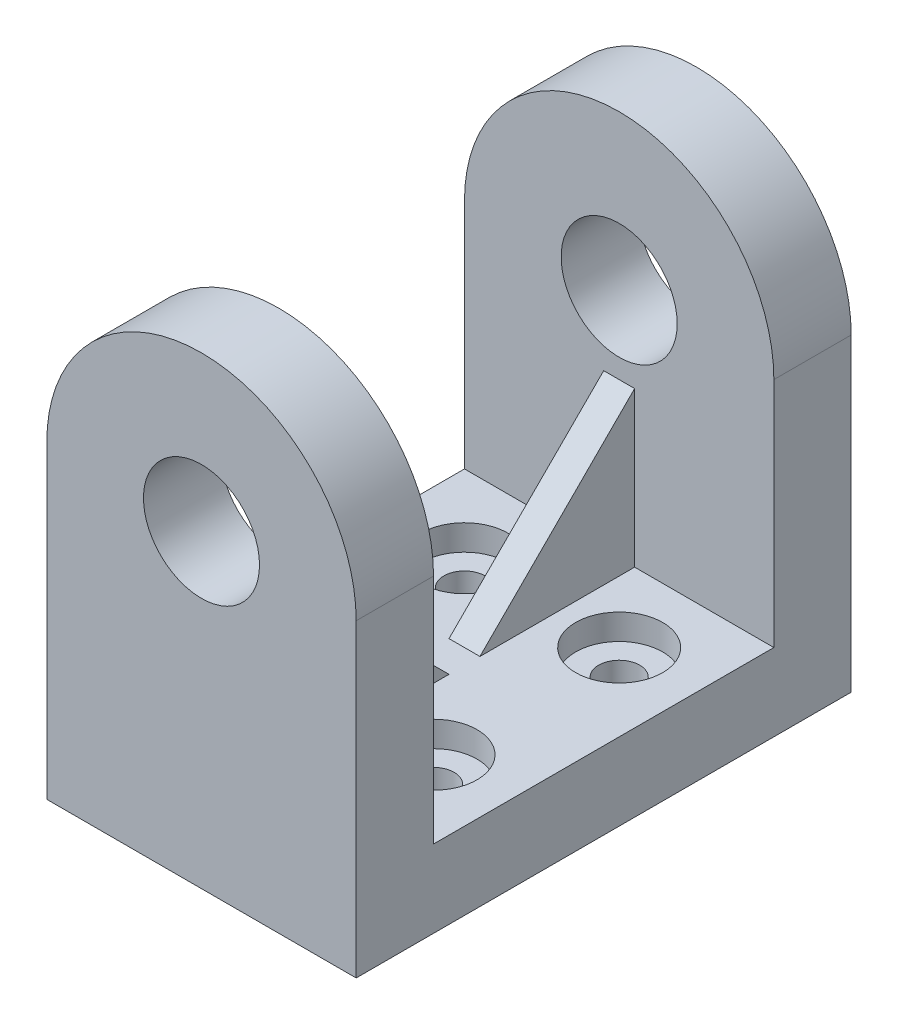
ISO-10303-21;
HEADER;
FILE_DESCRIPTION(('STEP AP214'),'2;1');
FILE_NAME('part.step','',(''),(''),'','','');
FILE_SCHEMA(('AUTOMOTIVE_DESIGN { 1 0 10303 214 1 1 1 1 }'));
ENDSEC;
DATA;
#1=APPLICATION_CONTEXT('core data for automotive mechanical design processes');
#2=APPLICATION_PROTOCOL_DEFINITION('international standard','automotive_design',2000,#1);
#3=PRODUCT_CONTEXT('',#1,'mechanical');
#4=PRODUCT('Part','Part','',(#3));
#5=PRODUCT_RELATED_PRODUCT_CATEGORY('part','',(#4));
#6=PRODUCT_DEFINITION_FORMATION('','',#4);
#7=PRODUCT_DEFINITION_CONTEXT('part definition',#1,'design');
#8=PRODUCT_DEFINITION('design','',#6,#7);
#9=PRODUCT_DEFINITION_SHAPE('','',#8);
#10=(LENGTH_UNIT() NAMED_UNIT(*) SI_UNIT(.MILLI.,.METRE.));
#11=(NAMED_UNIT(*) PLANE_ANGLE_UNIT() SI_UNIT($,.RADIAN.));
#12=(NAMED_UNIT(*) SI_UNIT($,.STERADIAN.) SOLID_ANGLE_UNIT());
#13=UNCERTAINTY_MEASURE_WITH_UNIT(LENGTH_MEASURE(1.E-05),#10,'distance_accuracy_value','');
#14=(GEOMETRIC_REPRESENTATION_CONTEXT(3) GLOBAL_UNCERTAINTY_ASSIGNED_CONTEXT((#13)) GLOBAL_UNIT_ASSIGNED_CONTEXT((#10,
#11,#12)) REPRESENTATION_CONTEXT('',''));
#15=CARTESIAN_POINT('',(0.,0.,0.));
#16=DIRECTION('',(0.,0.,1.));
#17=DIRECTION('',(1.,0.,0.));
#18=AXIS2_PLACEMENT_3D('',#15,#16,#17);
#19=CARTESIAN_POINT('',(0.,12.7,27.94));
#20=DIRECTION('',(0.,1.,0.));
#21=DIRECTION('',(-1.,0.,0.));
#22=AXIS2_PLACEMENT_3D('',#19,#20,#21);
#23=PLANE('',#22);
#24=CARTESIAN_POINT('',(-12.7,12.7,-15.24));
#25=DIRECTION('',(0.,1.,0.));
#26=DIRECTION('',(0.,0.,1.));
#27=AXIS2_PLACEMENT_3D('',#24,#25,#26);
#28=CIRCLE('',#27,7.14375);
#29=CARTESIAN_POINT('',(-12.7,12.7,-8.09625));
#30=VERTEX_POINT('',#29);
#31=EDGE_CURVE('E398',#30,#30,#28,.T.);
#32=ORIENTED_EDGE('',*,*,#31,.F.);
#33=EDGE_LOOP('',(#32));
#34=FACE_BOUND('',#33,.T.);
#35=CARTESIAN_POINT('',(-12.7,12.7,15.24));
#36=DIRECTION('',(0.,1.,0.));
#37=DIRECTION('',(0.,0.,1.));
#38=AXIS2_PLACEMENT_3D('',#35,#36,#37);
#39=CIRCLE('',#38,7.14375);
#40=CARTESIAN_POINT('',(-12.7,12.7,22.38375));
#41=VERTEX_POINT('',#40);
#42=EDGE_CURVE('E402',#41,#41,#39,.T.);
#43=ORIENTED_EDGE('',*,*,#42,.F.);
#44=EDGE_LOOP('',(#43));
#45=FACE_BOUND('',#44,.T.);
#46=CARTESIAN_POINT('',(12.7,12.7,-15.24));
#47=DIRECTION('',(0.,1.,0.));
#48=DIRECTION('',(0.,0.,1.));
#49=AXIS2_PLACEMENT_3D('',#46,#47,#48);
#50=CIRCLE('',#49,7.14375);
#51=CARTESIAN_POINT('',(12.7,12.7,-8.09625));
#52=VERTEX_POINT('',#51);
#53=EDGE_CURVE('E406',#52,#52,#50,.T.);
#54=ORIENTED_EDGE('',*,*,#53,.F.);
#55=EDGE_LOOP('',(#54));
#56=FACE_BOUND('',#55,.T.);
#57=CARTESIAN_POINT('',(12.7,12.7,15.24));
#58=DIRECTION('',(0.,1.,0.));
#59=DIRECTION('',(0.,0.,1.));
#60=AXIS2_PLACEMENT_3D('',#57,#58,#59);
#61=CIRCLE('',#60,7.14375);
#62=CARTESIAN_POINT('',(12.7,12.7,22.38375));
#63=VERTEX_POINT('',#62);
#64=EDGE_CURVE('E409',#63,#63,#61,.T.);
#65=ORIENTED_EDGE('',*,*,#64,.F.);
#66=EDGE_LOOP('',(#65));
#67=FACE_BOUND('',#66,.T.);
#68=DIRECTION('',(0.,0.,-1.));
#69=VECTOR('',#68,1.);
#70=CARTESIAN_POINT('',(2.54,12.7,27.94));
#71=LINE('',#70,#69);
#72=CARTESIAN_POINT('',(2.54,12.7,-2.54000000000009));
#73=VERTEX_POINT('',#72);
#74=CARTESIAN_POINT('',(2.54,12.7,-27.94));
#75=VERTEX_POINT('',#74);
#76=EDGE_CURVE('E167',#73,#75,#71,.T.);
#77=ORIENTED_EDGE('',*,*,#76,.F.);
#78=DIRECTION('',(1.,0.,0.));
#79=VECTOR('',#78,1.);
#80=CARTESIAN_POINT('',(0.,12.7,-2.5400000000001));
#81=LINE('',#80,#79);
#82=CARTESIAN_POINT('',(-2.54,12.7,-2.54000000000009));
#83=VERTEX_POINT('',#82);
#84=EDGE_CURVE('E157',#83,#73,#81,.T.);
#85=ORIENTED_EDGE('',*,*,#84,.F.);
#86=DIRECTION('',(0.,0.,-1.));
#87=VECTOR('',#86,1.);
#88=CARTESIAN_POINT('',(-2.54,12.7,27.94));
#89=LINE('',#88,#87);
#90=CARTESIAN_POINT('',(-2.54,12.7,-27.94));
#91=VERTEX_POINT('',#90);
#92=EDGE_CURVE('E144',#83,#91,#89,.T.);
#93=ORIENTED_EDGE('',*,*,#92,.T.);
#94=DIRECTION('',(1.,0.,0.));
#95=VECTOR('',#94,1.);
#96=CARTESIAN_POINT('',(0.,12.7,-27.94));
#97=LINE('',#96,#95);
#98=CARTESIAN_POINT('',(-25.4,12.7,-27.94));
#99=VERTEX_POINT('',#98);
#100=EDGE_CURVE('E285',#99,#91,#97,.T.);
#101=ORIENTED_EDGE('',*,*,#100,.F.);
#102=DIRECTION('',(0.,0.,-1.));
#103=VECTOR('',#102,1.);
#104=CARTESIAN_POINT('',(-25.4,12.7,27.94));
#105=LINE('',#104,#103);
#106=CARTESIAN_POINT('',(-25.4,12.7,27.94));
#107=VERTEX_POINT('',#106);
#108=EDGE_CURVE('E11',#107,#99,#105,.T.);
#109=ORIENTED_EDGE('',*,*,#108,.F.);
#110=DIRECTION('',(1.,0.,0.));
#111=VECTOR('',#110,1.);
#112=CARTESIAN_POINT('',(0.,12.7,27.94));
#113=LINE('',#112,#111);
#114=CARTESIAN_POINT('',(-2.54,12.7,27.94));
#115=VERTEX_POINT('',#114);
#116=EDGE_CURVE('E279',#107,#115,#113,.T.);
#117=ORIENTED_EDGE('',*,*,#116,.T.);
#118=DIRECTION('',(0.,0.,-1.));
#119=VECTOR('',#118,1.);
#120=CARTESIAN_POINT('',(-2.54,12.7,27.94));
#121=LINE('',#120,#119);
#122=CARTESIAN_POINT('',(-2.54,12.7,2.54000000000009));
#123=VERTEX_POINT('',#122);
#124=EDGE_CURVE('E187',#115,#123,#121,.T.);
#125=ORIENTED_EDGE('',*,*,#124,.T.);
#126=DIRECTION('',(1.,0.,0.));
#127=VECTOR('',#126,1.);
#128=CARTESIAN_POINT('',(0.,12.7,2.5400000000001));
#129=LINE('',#128,#127);
#130=CARTESIAN_POINT('',(2.54,12.7,2.5400000000001));
#131=VERTEX_POINT('',#130);
#132=EDGE_CURVE('E69',#131,#123,#129,.F.);
#133=ORIENTED_EDGE('',*,*,#132,.F.);
#134=DIRECTION('',(0.,0.,-1.));
#135=VECTOR('',#134,1.);
#136=CARTESIAN_POINT('',(2.54,12.7,27.94));
#137=LINE('',#136,#135);
#138=CARTESIAN_POINT('',(2.54,12.7,27.94));
#139=VERTEX_POINT('',#138);
#140=EDGE_CURVE('E193',#139,#131,#137,.T.);
#141=ORIENTED_EDGE('',*,*,#140,.F.);
#142=CARTESIAN_POINT('',(25.4,12.7,27.94));
#143=VERTEX_POINT('',#142);
#144=EDGE_CURVE('E284',#139,#143,#113,.T.);
#145=ORIENTED_EDGE('',*,*,#144,.T.);
#146=DIRECTION('',(0.,0.,-1.));
#147=VECTOR('',#146,1.);
#148=CARTESIAN_POINT('',(25.4,12.7,27.94));
#149=LINE('',#148,#147);
#150=CARTESIAN_POINT('',(25.4,12.7,-27.94));
#151=VERTEX_POINT('',#150);
#152=EDGE_CURVE('E283',#143,#151,#149,.T.);
#153=ORIENTED_EDGE('',*,*,#152,.T.);
#154=EDGE_CURVE('E275',#75,#151,#97,.T.);
#155=ORIENTED_EDGE('',*,*,#154,.F.);
#156=EDGE_LOOP('',(#77,#85,#93,#101,#109,#117,#125,#133,#141,#145,#153,#155));
#157=FACE_BOUND('',#156,.T.);
#158=ADVANCED_FACE('F45',(#34,#45,#56,#67,#157),#23,.T.);
#159=CARTESIAN_POINT('',(-25.4,0.,27.94));
#160=DIRECTION('',(1.,0.,0.));
#161=DIRECTION('',(0.,1.,0.));
#162=AXIS2_PLACEMENT_3D('',#159,#160,#161);
#163=PLANE('',#162);
#164=ORIENTED_EDGE('',*,*,#108,.T.);
#165=DIRECTION('',(0.,-1.,0.));
#166=VECTOR('',#165,1.);
#167=CARTESIAN_POINT('',(-25.4,0.,-27.94));
#168=LINE('',#167,#166);
#169=CARTESIAN_POINT('',(-25.4,50.8,-27.94));
#170=VERTEX_POINT('',#169);
#171=EDGE_CURVE('E234',#170,#99,#168,.T.);
#172=ORIENTED_EDGE('',*,*,#171,.F.);
#173=DIRECTION('',(0.,0.,1.));
#174=VECTOR('',#173,1.);
#175=CARTESIAN_POINT('',(-25.4,50.8,-40.64));
#176=LINE('',#175,#174);
#177=CARTESIAN_POINT('',(-25.4,50.8,-40.64));
#178=VERTEX_POINT('',#177);
#179=EDGE_CURVE('E230',#178,#170,#176,.T.);
#180=ORIENTED_EDGE('',*,*,#179,.F.);
#181=DIRECTION('',(0.,-1.,0.));
#182=VECTOR('',#181,1.);
#183=CARTESIAN_POINT('',(-25.4,0.,-40.64));
#184=LINE('',#183,#182);
#185=CARTESIAN_POINT('',(-25.4,0.,-40.64));
#186=VERTEX_POINT('',#185);
#187=EDGE_CURVE('E218',#178,#186,#184,.T.);
#188=ORIENTED_EDGE('',*,*,#187,.T.);
#189=DIRECTION('',(0.,0.,-1.));
#190=VECTOR('',#189,1.);
#191=CARTESIAN_POINT('',(-25.4,0.,27.94));
#192=LINE('',#191,#190);
#193=CARTESIAN_POINT('',(-25.4,0.,40.64));
#194=VERTEX_POINT('',#193);
#195=EDGE_CURVE('E54',#194,#186,#192,.T.);
#196=ORIENTED_EDGE('',*,*,#195,.F.);
#197=DIRECTION('',(0.,1.,0.));
#198=VECTOR('',#197,1.);
#199=CARTESIAN_POINT('',(-25.4,0.,40.64));
#200=LINE('',#199,#198);
#201=CARTESIAN_POINT('',(-25.4,50.8,40.64));
#202=VERTEX_POINT('',#201);
#203=EDGE_CURVE('E255',#194,#202,#200,.T.);
#204=ORIENTED_EDGE('',*,*,#203,.T.);
#205=DIRECTION('',(0.,0.,-1.));
#206=VECTOR('',#205,1.);
#207=CARTESIAN_POINT('',(-25.4,50.8,40.64));
#208=LINE('',#207,#206);
#209=CARTESIAN_POINT('',(-25.4,50.8,27.94));
#210=VERTEX_POINT('',#209);
#211=EDGE_CURVE('E262',#202,#210,#208,.T.);
#212=ORIENTED_EDGE('',*,*,#211,.T.);
#213=DIRECTION('',(0.,1.,0.));
#214=VECTOR('',#213,1.);
#215=CARTESIAN_POINT('',(-25.4,0.,27.94));
#216=LINE('',#215,#214);
#217=EDGE_CURVE('E266',#107,#210,#216,.T.);
#218=ORIENTED_EDGE('',*,*,#217,.F.);
#219=EDGE_LOOP('',(#164,#172,#180,#188,#196,#204,#212,#218));
#220=FACE_BOUND('',#219,.T.);
#221=ADVANCED_FACE('F309',(#220),#163,.F.);
#222=CARTESIAN_POINT('',(0.,0.,27.94));
#223=DIRECTION('',(0.,1.,0.));
#224=DIRECTION('',(-1.,0.,0.));
#225=AXIS2_PLACEMENT_3D('',#222,#223,#224);
#226=PLANE('',#225);
#227=CARTESIAN_POINT('',(-12.7,0.,-15.24));
#228=DIRECTION('',(0.,1.,0.));
#229=DIRECTION('',(0.,0.,1.));
#230=AXIS2_PLACEMENT_3D('',#227,#228,#229);
#231=CIRCLE('',#230,3.3782);
#232=CARTESIAN_POINT('',(-12.7,0.,-11.8618));
#233=VERTEX_POINT('',#232);
#234=EDGE_CURVE('E529',#233,#233,#231,.T.);
#235=ORIENTED_EDGE('',*,*,#234,.T.);
#236=EDGE_LOOP('',(#235));
#237=FACE_BOUND('',#236,.T.);
#238=CARTESIAN_POINT('',(-12.7,0.,15.24));
#239=DIRECTION('',(0.,1.,0.));
#240=DIRECTION('',(0.,0.,1.));
#241=AXIS2_PLACEMENT_3D('',#238,#239,#240);
#242=CIRCLE('',#241,3.3782);
#243=CARTESIAN_POINT('',(-12.7,0.,18.6182));
#244=VERTEX_POINT('',#243);
#245=EDGE_CURVE('E543',#244,#244,#242,.T.);
#246=ORIENTED_EDGE('',*,*,#245,.T.);
#247=EDGE_LOOP('',(#246));
#248=FACE_BOUND('',#247,.T.);
#249=CARTESIAN_POINT('',(12.7,0.,-15.24));
#250=DIRECTION('',(0.,1.,0.));
#251=DIRECTION('',(0.,0.,1.));
#252=AXIS2_PLACEMENT_3D('',#249,#250,#251);
#253=CIRCLE('',#252,3.3782);
#254=CARTESIAN_POINT('',(12.7,0.,-11.8618));
#255=VERTEX_POINT('',#254);
#256=EDGE_CURVE('E413',#255,#255,#253,.T.);
#257=ORIENTED_EDGE('',*,*,#256,.T.);
#258=EDGE_LOOP('',(#257));
#259=FACE_BOUND('',#258,.T.);
#260=CARTESIAN_POINT('',(12.7,0.,15.24));
#261=DIRECTION('',(0.,1.,0.));
#262=DIRECTION('',(0.,0.,1.));
#263=AXIS2_PLACEMENT_3D('',#260,#261,#262);
#264=CIRCLE('',#263,3.3782);
#265=CARTESIAN_POINT('',(12.7,0.,18.6182));
#266=VERTEX_POINT('',#265);
#267=EDGE_CURVE('E163',#266,#266,#264,.T.);
#268=ORIENTED_EDGE('',*,*,#267,.T.);
#269=EDGE_LOOP('',(#268));
#270=FACE_BOUND('',#269,.T.);
#271=DIRECTION('',(1.,0.,0.));
#272=VECTOR('',#271,1.);
#273=CARTESIAN_POINT('',(0.,0.,-40.64));
#274=LINE('',#273,#272);
#275=CARTESIAN_POINT('',(25.4,0.,-40.64));
#276=VERTEX_POINT('',#275);
#277=EDGE_CURVE('E223',#186,#276,#274,.T.);
#278=ORIENTED_EDGE('',*,*,#277,.T.);
#279=DIRECTION('',(0.,0.,-1.));
#280=VECTOR('',#279,1.);
#281=CARTESIAN_POINT('',(25.4,0.,27.94));
#282=LINE('',#281,#280);
#283=CARTESIAN_POINT('',(25.4,0.,40.64));
#284=VERTEX_POINT('',#283);
#285=EDGE_CURVE('E291',#284,#276,#282,.T.);
#286=ORIENTED_EDGE('',*,*,#285,.F.);
#287=DIRECTION('',(-1.,0.,0.));
#288=VECTOR('',#287,1.);
#289=CARTESIAN_POINT('',(0.,0.,40.64));
#290=LINE('',#289,#288);
#291=EDGE_CURVE('E251',#284,#194,#290,.T.);
#292=ORIENTED_EDGE('',*,*,#291,.T.);
#293=ORIENTED_EDGE('',*,*,#195,.T.);
#294=EDGE_LOOP('',(#278,#286,#292,#293));
#295=FACE_BOUND('',#294,.T.);
#296=ADVANCED_FACE('F300',(#237,#248,#259,#270,#295),#226,.F.);
#297=CARTESIAN_POINT('',(25.4,0.,27.94));
#298=DIRECTION('',(-1.,0.,0.));
#299=DIRECTION('',(0.,-1.,0.));
#300=AXIS2_PLACEMENT_3D('',#297,#298,#299);
#301=PLANE('',#300);
#302=ORIENTED_EDGE('',*,*,#285,.T.);
#303=DIRECTION('',(0.,1.,0.));
#304=VECTOR('',#303,1.);
#305=CARTESIAN_POINT('',(25.4,0.,-40.64));
#306=LINE('',#305,#304);
#307=CARTESIAN_POINT('',(25.4,50.8,-40.64));
#308=VERTEX_POINT('',#307);
#309=EDGE_CURVE('E226',#276,#308,#306,.T.);
#310=ORIENTED_EDGE('',*,*,#309,.T.);
#311=DIRECTION('',(0.,0.,1.));
#312=VECTOR('',#311,1.);
#313=CARTESIAN_POINT('',(25.4,50.8,-40.64));
#314=LINE('',#313,#312);
#315=CARTESIAN_POINT('',(25.4,50.8,-27.94));
#316=VERTEX_POINT('',#315);
#317=EDGE_CURVE('E240',#308,#316,#314,.T.);
#318=ORIENTED_EDGE('',*,*,#317,.T.);
#319=DIRECTION('',(0.,1.,0.));
#320=VECTOR('',#319,1.);
#321=CARTESIAN_POINT('',(25.4,0.,-27.94));
#322=LINE('',#321,#320);
#323=EDGE_CURVE('E219',#151,#316,#322,.T.);
#324=ORIENTED_EDGE('',*,*,#323,.F.);
#325=ORIENTED_EDGE('',*,*,#152,.F.);
#326=DIRECTION('',(0.,-1.,0.));
#327=VECTOR('',#326,1.);
#328=CARTESIAN_POINT('',(25.4,0.,27.94));
#329=LINE('',#328,#327);
#330=CARTESIAN_POINT('',(25.4,50.8,27.94));
#331=VERTEX_POINT('',#330);
#332=EDGE_CURVE('E244',#331,#143,#329,.T.);
#333=ORIENTED_EDGE('',*,*,#332,.F.);
#334=DIRECTION('',(0.,0.,-1.));
#335=VECTOR('',#334,1.);
#336=CARTESIAN_POINT('',(25.4,50.8,40.64));
#337=LINE('',#336,#335);
#338=CARTESIAN_POINT('',(25.4,50.8,40.64));
#339=VERTEX_POINT('',#338);
#340=EDGE_CURVE('E272',#339,#331,#337,.T.);
#341=ORIENTED_EDGE('',*,*,#340,.F.);
#342=DIRECTION('',(0.,-1.,0.));
#343=VECTOR('',#342,1.);
#344=CARTESIAN_POINT('',(25.4,0.,40.64));
#345=LINE('',#344,#343);
#346=EDGE_CURVE('E247',#339,#284,#345,.T.);
#347=ORIENTED_EDGE('',*,*,#346,.T.);
#348=EDGE_LOOP('',(#302,#310,#318,#324,#325,#333,#341,#347));
#349=FACE_BOUND('',#348,.T.);
#350=ADVANCED_FACE('F315',(#349),#301,.F.);
#351=CARTESIAN_POINT('',(0.,50.8,40.64));
#352=DIRECTION('',(0.,0.,-1.));
#353=DIRECTION('',(-1.,0.,0.));
#354=AXIS2_PLACEMENT_3D('',#351,#352,#353);
#355=CYLINDRICAL_SURFACE('',#354,25.4);
#356=CARTESIAN_POINT('',(0.,50.8,27.94));
#357=DIRECTION('',(0.,0.,1.));
#358=DIRECTION('',(1.,0.,0.));
#359=AXIS2_PLACEMENT_3D('',#356,#357,#358);
#360=CIRCLE('',#359,25.4);
#361=EDGE_CURVE('E252',#331,#210,#360,.T.);
#362=ORIENTED_EDGE('',*,*,#361,.T.);
#363=ORIENTED_EDGE('',*,*,#211,.F.);
#364=CARTESIAN_POINT('',(0.,50.8,40.64));
#365=DIRECTION('',(0.,0.,1.));
#366=DIRECTION('',(1.,0.,0.));
#367=AXIS2_PLACEMENT_3D('',#364,#365,#366);
#368=CIRCLE('',#367,25.4);
#369=EDGE_CURVE('E259',#339,#202,#368,.T.);
#370=ORIENTED_EDGE('',*,*,#369,.F.);
#371=ORIENTED_EDGE('',*,*,#340,.T.);
#372=EDGE_LOOP('',(#362,#363,#370,#371));
#373=FACE_BOUND('',#372,.T.);
#374=ADVANCED_FACE('F326',(#373),#355,.T.);
#375=CARTESIAN_POINT('',(0.,50.8,40.64));
#376=DIRECTION('',(0.,0.,1.));
#377=DIRECTION('',(1.,0.,0.));
#378=AXIS2_PLACEMENT_3D('',#375,#376,#377);
#379=PLANE('',#378);
#380=CARTESIAN_POINT('',(0.,50.8,40.64));
#381=DIRECTION('',(0.,0.,1.));
#382=DIRECTION('',(1.,0.,0.));
#383=AXIS2_PLACEMENT_3D('',#380,#381,#382);
#384=CIRCLE('',#383,9.525);
#385=CARTESIAN_POINT('',(9.52499999999999,50.8,40.64));
#386=VERTEX_POINT('',#385);
#387=EDGE_CURVE('E201',#386,#386,#384,.T.);
#388=ORIENTED_EDGE('',*,*,#387,.F.);
#389=EDGE_LOOP('',(#388));
#390=FACE_BOUND('',#389,.T.);
#391=ORIENTED_EDGE('',*,*,#203,.F.);
#392=ORIENTED_EDGE('',*,*,#291,.F.);
#393=ORIENTED_EDGE('',*,*,#346,.F.);
#394=ORIENTED_EDGE('',*,*,#369,.T.);
#395=EDGE_LOOP('',(#391,#392,#393,#394));
#396=FACE_BOUND('',#395,.T.);
#397=ADVANCED_FACE('F319',(#390,#396),#379,.T.);
#398=CARTESIAN_POINT('',(0.,50.8,27.94));
#399=DIRECTION('',(0.,0.,1.));
#400=DIRECTION('',(1.,0.,0.));
#401=AXIS2_PLACEMENT_3D('',#398,#399,#400);
#402=PLANE('',#401);
#403=CARTESIAN_POINT('',(0.,50.8,27.94));
#404=DIRECTION('',(0.,0.,1.));
#405=DIRECTION('',(1.,0.,0.));
#406=AXIS2_PLACEMENT_3D('',#403,#404,#405);
#407=CIRCLE('',#406,9.525);
#408=CARTESIAN_POINT('',(9.52499999999999,50.8,27.94));
#409=VERTEX_POINT('',#408);
#410=EDGE_CURVE('E209',#409,#409,#407,.T.);
#411=ORIENTED_EDGE('',*,*,#410,.T.);
#412=EDGE_LOOP('',(#411));
#413=FACE_BOUND('',#412,.T.);
#414=ORIENTED_EDGE('',*,*,#144,.F.);
#415=DIRECTION('',(0.,1.,0.));
#416=VECTOR('',#415,1.);
#417=CARTESIAN_POINT('',(2.54,50.8,27.94));
#418=LINE('',#417,#416);
#419=CARTESIAN_POINT('',(2.54,38.1,27.94));
#420=VERTEX_POINT('',#419);
#421=EDGE_CURVE('E190',#139,#420,#418,.T.);
#422=ORIENTED_EDGE('',*,*,#421,.T.);
#423=DIRECTION('',(1.,0.,0.));
#424=VECTOR('',#423,1.);
#425=CARTESIAN_POINT('',(0.,38.1,27.94));
#426=LINE('',#425,#424);
#427=CARTESIAN_POINT('',(-2.54,38.1,27.94));
#428=VERTEX_POINT('',#427);
#429=EDGE_CURVE('E196',#420,#428,#426,.F.);
#430=ORIENTED_EDGE('',*,*,#429,.T.);
#431=DIRECTION('',(0.,1.,0.));
#432=VECTOR('',#431,1.);
#433=CARTESIAN_POINT('',(-2.54,50.8,27.94));
#434=LINE('',#433,#432);
#435=EDGE_CURVE('E182',#115,#428,#434,.T.);
#436=ORIENTED_EDGE('',*,*,#435,.F.);
#437=ORIENTED_EDGE('',*,*,#116,.F.);
#438=ORIENTED_EDGE('',*,*,#217,.T.);
#439=ORIENTED_EDGE('',*,*,#361,.F.);
#440=ORIENTED_EDGE('',*,*,#332,.T.);
#441=EDGE_LOOP('',(#414,#422,#430,#436,#437,#438,#439,#440));
#442=FACE_BOUND('',#441,.T.);
#443=ADVANCED_FACE('F330',(#413,#442),#402,.F.);
#444=CARTESIAN_POINT('',(0.,50.8,-40.64));
#445=DIRECTION('',(0.,0.,1.));
#446=DIRECTION('',(1.,0.,0.));
#447=AXIS2_PLACEMENT_3D('',#444,#445,#446);
#448=CYLINDRICAL_SURFACE('',#447,25.4);
#449=CARTESIAN_POINT('',(0.,50.8,-27.94));
#450=DIRECTION('',(0.,0.,1.));
#451=DIRECTION('',(1.,0.,0.));
#452=AXIS2_PLACEMENT_3D('',#449,#450,#451);
#453=CIRCLE('',#452,25.4);
#454=EDGE_CURVE('E213',#316,#170,#453,.T.);
#455=ORIENTED_EDGE('',*,*,#454,.F.);
#456=ORIENTED_EDGE('',*,*,#317,.F.);
#457=CARTESIAN_POINT('',(0.,50.8,-40.64));
#458=DIRECTION('',(0.,0.,1.));
#459=DIRECTION('',(1.,0.,0.));
#460=AXIS2_PLACEMENT_3D('',#457,#458,#459);
#461=CIRCLE('',#460,25.4);
#462=EDGE_CURVE('E214',#308,#178,#461,.T.);
#463=ORIENTED_EDGE('',*,*,#462,.T.);
#464=ORIENTED_EDGE('',*,*,#179,.T.);
#465=EDGE_LOOP('',(#455,#456,#463,#464));
#466=FACE_BOUND('',#465,.T.);
#467=ADVANCED_FACE('F313',(#466),#448,.T.);
#468=CARTESIAN_POINT('',(0.,50.8,-40.64));
#469=DIRECTION('',(0.,0.,1.));
#470=DIRECTION('',(1.,0.,0.));
#471=AXIS2_PLACEMENT_3D('',#468,#469,#470);
#472=PLANE('',#471);
#473=CARTESIAN_POINT('',(0.,50.8,-40.64));
#474=DIRECTION('',(0.,0.,1.));
#475=DIRECTION('',(1.,0.,0.));
#476=AXIS2_PLACEMENT_3D('',#473,#474,#475);
#477=CIRCLE('',#476,9.525);
#478=CARTESIAN_POINT('',(9.52499999999999,50.8,-40.64));
#479=VERTEX_POINT('',#478);
#480=EDGE_CURVE('E202',#479,#479,#477,.T.);
#481=ORIENTED_EDGE('',*,*,#480,.T.);
#482=EDGE_LOOP('',(#481));
#483=FACE_BOUND('',#482,.T.);
#484=ORIENTED_EDGE('',*,*,#309,.F.);
#485=ORIENTED_EDGE('',*,*,#277,.F.);
#486=ORIENTED_EDGE('',*,*,#187,.F.);
#487=ORIENTED_EDGE('',*,*,#462,.F.);
#488=EDGE_LOOP('',(#484,#485,#486,#487));
#489=FACE_BOUND('',#488,.T.);
#490=ADVANCED_FACE('F307',(#483,#489),#472,.F.);
#491=CARTESIAN_POINT('',(0.,50.8,-27.94));
#492=DIRECTION('',(0.,0.,1.));
#493=DIRECTION('',(1.,0.,0.));
#494=AXIS2_PLACEMENT_3D('',#491,#492,#493);
#495=PLANE('',#494);
#496=DIRECTION('',(0.,1.,0.));
#497=VECTOR('',#496,1.);
#498=CARTESIAN_POINT('',(2.54,50.8,-27.94));
#499=LINE('',#498,#497);
#500=CARTESIAN_POINT('',(2.54,38.1,-27.94));
#501=VERTEX_POINT('',#500);
#502=EDGE_CURVE('E152',#75,#501,#499,.T.);
#503=ORIENTED_EDGE('',*,*,#502,.F.);
#504=ORIENTED_EDGE('',*,*,#154,.T.);
#505=ORIENTED_EDGE('',*,*,#323,.T.);
#506=ORIENTED_EDGE('',*,*,#454,.T.);
#507=ORIENTED_EDGE('',*,*,#171,.T.);
#508=ORIENTED_EDGE('',*,*,#100,.T.);
#509=DIRECTION('',(0.,1.,0.));
#510=VECTOR('',#509,1.);
#511=CARTESIAN_POINT('',(-2.54,50.8,-27.94));
#512=LINE('',#511,#510);
#513=CARTESIAN_POINT('',(-2.54,38.1,-27.94));
#514=VERTEX_POINT('',#513);
#515=EDGE_CURVE('E147',#91,#514,#512,.T.);
#516=ORIENTED_EDGE('',*,*,#515,.T.);
#517=DIRECTION('',(-1.,0.,0.));
#518=VECTOR('',#517,1.);
#519=CARTESIAN_POINT('',(0.,38.1,-27.94));
#520=LINE('',#519,#518);
#521=EDGE_CURVE('E160',#501,#514,#520,.T.);
#522=ORIENTED_EDGE('',*,*,#521,.F.);
#523=EDGE_LOOP('',(#503,#504,#505,#506,#507,#508,#516,#522));
#524=FACE_BOUND('',#523,.T.);
#525=CARTESIAN_POINT('',(0.,50.8,-27.94));
#526=DIRECTION('',(0.,0.,1.));
#527=DIRECTION('',(1.,0.,0.));
#528=AXIS2_PLACEMENT_3D('',#525,#526,#527);
#529=CIRCLE('',#528,9.525);
#530=CARTESIAN_POINT('',(9.52499999999999,50.8,-27.94));
#531=VERTEX_POINT('',#530);
#532=EDGE_CURVE('E48',#531,#531,#529,.T.);
#533=ORIENTED_EDGE('',*,*,#532,.F.);
#534=EDGE_LOOP('',(#533));
#535=FACE_BOUND('',#534,.T.);
#536=ADVANCED_FACE('F376',(#524,#535),#495,.T.);
#537=CARTESIAN_POINT('',(0.,50.8,-40.64));
#538=DIRECTION('',(0.,0.,1.));
#539=DIRECTION('',(1.,0.,0.));
#540=AXIS2_PLACEMENT_3D('',#537,#538,#539);
#541=CYLINDRICAL_SURFACE('',#540,9.525);
#542=ORIENTED_EDGE('',*,*,#532,.T.);
#543=EDGE_LOOP('',(#542));
#544=FACE_BOUND('',#543,.T.);
#545=ORIENTED_EDGE('',*,*,#480,.F.);
#546=EDGE_LOOP('',(#545));
#547=FACE_BOUND('',#546,.T.);
#548=ADVANCED_FACE('F373',(#544,#547),#541,.F.);
#549=ORIENTED_EDGE('',*,*,#387,.T.);
#550=EDGE_LOOP('',(#549));
#551=FACE_BOUND('',#550,.T.);
#552=ORIENTED_EDGE('',*,*,#410,.F.);
#553=EDGE_LOOP('',(#552));
#554=FACE_BOUND('',#553,.T.);
#555=ADVANCED_FACE('F384',(#551,#554),#541,.F.);
#556=CARTESIAN_POINT('',(0.,38.1,27.94));
#557=DIRECTION('',(0.,-0.707106781186546,0.707106781186549));
#558=DIRECTION('',(0.,-0.707106781186549,-0.707106781186546));
#559=AXIS2_PLACEMENT_3D('',#556,#557,#558);
#560=PLANE('',#559);
#561=DIRECTION('',(0.,-0.707106781186549,-0.707106781186546));
#562=VECTOR('',#561,1.);
#563=CARTESIAN_POINT('',(2.54,38.1,27.94));
#564=LINE('',#563,#562);
#565=EDGE_CURVE('E175',#420,#131,#564,.T.);
#566=ORIENTED_EDGE('',*,*,#565,.T.);
#567=ORIENTED_EDGE('',*,*,#132,.T.);
#568=DIRECTION('',(0.,-0.707106781186549,-0.707106781186546));
#569=VECTOR('',#568,1.);
#570=CARTESIAN_POINT('',(-2.54,38.1,27.94));
#571=LINE('',#570,#569);
#572=EDGE_CURVE('E169',#428,#123,#571,.T.);
#573=ORIENTED_EDGE('',*,*,#572,.F.);
#574=ORIENTED_EDGE('',*,*,#429,.F.);
#575=EDGE_LOOP('',(#566,#567,#573,#574));
#576=FACE_BOUND('',#575,.T.);
#577=ADVANCED_FACE('F447',(#576),#560,.F.);
#578=CARTESIAN_POINT('',(2.54,38.1,0.));
#579=DIRECTION('',(1.,0.,0.));
#580=DIRECTION('',(0.,0.,-1.));
#581=AXIS2_PLACEMENT_3D('',#578,#579,#580);
#582=PLANE('',#581);
#583=ORIENTED_EDGE('',*,*,#421,.F.);
#584=ORIENTED_EDGE('',*,*,#140,.T.);
#585=ORIENTED_EDGE('',*,*,#565,.F.);
#586=EDGE_LOOP('',(#583,#584,#585));
#587=FACE_BOUND('',#586,.T.);
#588=ADVANCED_FACE('F450',(#587),#582,.T.);
#589=CARTESIAN_POINT('',(-2.54,38.1,0.));
#590=DIRECTION('',(1.,0.,0.));
#591=DIRECTION('',(0.,0.,-1.));
#592=AXIS2_PLACEMENT_3D('',#589,#590,#591);
#593=PLANE('',#592);
#594=ORIENTED_EDGE('',*,*,#124,.F.);
#595=ORIENTED_EDGE('',*,*,#435,.T.);
#596=ORIENTED_EDGE('',*,*,#572,.T.);
#597=EDGE_LOOP('',(#594,#595,#596));
#598=FACE_BOUND('',#597,.T.);
#599=ADVANCED_FACE('F443',(#598),#593,.F.);
#600=CARTESIAN_POINT('',(0.,38.1,-27.94));
#601=DIRECTION('',(0.,0.707106781186546,0.707106781186549));
#602=DIRECTION('',(0.,-0.707106781186549,0.707106781186546));
#603=AXIS2_PLACEMENT_3D('',#600,#601,#602);
#604=PLANE('',#603);
#605=DIRECTION('',(0.,-0.707106781186549,0.707106781186546));
#606=VECTOR('',#605,1.);
#607=CARTESIAN_POINT('',(-2.54,38.1,-27.94));
#608=LINE('',#607,#606);
#609=EDGE_CURVE('E61',#514,#83,#608,.T.);
#610=ORIENTED_EDGE('',*,*,#609,.T.);
#611=ORIENTED_EDGE('',*,*,#84,.T.);
#612=DIRECTION('',(0.,-0.707106781186549,0.707106781186546));
#613=VECTOR('',#612,1.);
#614=CARTESIAN_POINT('',(2.54,38.1,-27.94));
#615=LINE('',#614,#613);
#616=EDGE_CURVE('E162',#501,#73,#615,.T.);
#617=ORIENTED_EDGE('',*,*,#616,.F.);
#618=ORIENTED_EDGE('',*,*,#521,.T.);
#619=EDGE_LOOP('',(#610,#611,#617,#618));
#620=FACE_BOUND('',#619,.T.);
#621=ADVANCED_FACE('F155',(#620),#604,.T.);
#622=CARTESIAN_POINT('',(2.54,38.1,0.));
#623=DIRECTION('',(1.,0.,0.));
#624=DIRECTION('',(0.,0.,-1.));
#625=AXIS2_PLACEMENT_3D('',#622,#623,#624);
#626=PLANE('',#625);
#627=ORIENTED_EDGE('',*,*,#616,.T.);
#628=ORIENTED_EDGE('',*,*,#76,.T.);
#629=ORIENTED_EDGE('',*,*,#502,.T.);
#630=EDGE_LOOP('',(#627,#628,#629));
#631=FACE_BOUND('',#630,.T.);
#632=ADVANCED_FACE('F440',(#631),#626,.T.);
#633=CARTESIAN_POINT('',(-2.54,38.1,0.));
#634=DIRECTION('',(1.,0.,0.));
#635=DIRECTION('',(0.,0.,-1.));
#636=AXIS2_PLACEMENT_3D('',#633,#634,#635);
#637=PLANE('',#636);
#638=ORIENTED_EDGE('',*,*,#92,.F.);
#639=ORIENTED_EDGE('',*,*,#609,.F.);
#640=ORIENTED_EDGE('',*,*,#515,.F.);
#641=EDGE_LOOP('',(#638,#639,#640));
#642=FACE_BOUND('',#641,.T.);
#643=ADVANCED_FACE('F145',(#642),#637,.F.);
#644=CARTESIAN_POINT('',(12.7,12.7,15.24));
#645=DIRECTION('',(0.,1.,0.));
#646=DIRECTION('',(0.,0.,1.));
#647=AXIS2_PLACEMENT_3D('',#644,#645,#646);
#648=CYLINDRICAL_SURFACE('',#647,3.3782);
#649=ORIENTED_EDGE('',*,*,#267,.F.);
#650=EDGE_LOOP('',(#649));
#651=FACE_BOUND('',#650,.T.);
#652=CARTESIAN_POINT('',(12.7,8.50900000000001,15.24));
#653=DIRECTION('',(0.,1.,0.));
#654=DIRECTION('',(0.,0.,1.));
#655=AXIS2_PLACEMENT_3D('',#652,#653,#654);
#656=CIRCLE('',#655,3.3782);
#657=CARTESIAN_POINT('',(12.7,8.50900000000001,18.6182));
#658=VERTEX_POINT('',#657);
#659=EDGE_CURVE('E419',#658,#658,#656,.T.);
#660=ORIENTED_EDGE('',*,*,#659,.T.);
#661=EDGE_LOOP('',(#660));
#662=FACE_BOUND('',#661,.T.);
#663=ADVANCED_FACE('F464',(#651,#662),#648,.F.);
#664=CARTESIAN_POINT('',(16.0782,8.50900000000001,15.24));
#665=DIRECTION('',(0.,-1.,0.));
#666=DIRECTION('',(0.,0.,-1.));
#667=AXIS2_PLACEMENT_3D('',#664,#665,#666);
#668=PLANE('',#667);
#669=ORIENTED_EDGE('',*,*,#659,.F.);
#670=EDGE_LOOP('',(#669));
#671=FACE_BOUND('',#670,.T.);
#672=CARTESIAN_POINT('',(12.7,8.50900000000001,15.24));
#673=DIRECTION('',(0.,1.,0.));
#674=DIRECTION('',(0.,0.,1.));
#675=AXIS2_PLACEMENT_3D('',#672,#673,#674);
#676=CIRCLE('',#675,7.14375);
#677=CARTESIAN_POINT('',(12.7,8.50900000000001,22.38375));
#678=VERTEX_POINT('',#677);
#679=EDGE_CURVE('E412',#678,#678,#676,.T.);
#680=ORIENTED_EDGE('',*,*,#679,.T.);
#681=EDGE_LOOP('',(#680));
#682=FACE_BOUND('',#681,.T.);
#683=ADVANCED_FACE('F469',(#671,#682),#668,.F.);
#684=CARTESIAN_POINT('',(12.7,12.7,15.24));
#685=DIRECTION('',(0.,1.,0.));
#686=DIRECTION('',(0.,0.,1.));
#687=AXIS2_PLACEMENT_3D('',#684,#685,#686);
#688=CYLINDRICAL_SURFACE('',#687,7.14375);
#689=ORIENTED_EDGE('',*,*,#679,.F.);
#690=EDGE_LOOP('',(#689));
#691=FACE_BOUND('',#690,.T.);
#692=ORIENTED_EDGE('',*,*,#64,.T.);
#693=EDGE_LOOP('',(#692));
#694=FACE_BOUND('',#693,.T.);
#695=ADVANCED_FACE('F473',(#691,#694),#688,.F.);
#696=CARTESIAN_POINT('',(12.7,12.7,-15.24));
#697=DIRECTION('',(0.,1.,0.));
#698=DIRECTION('',(0.,0.,1.));
#699=AXIS2_PLACEMENT_3D('',#696,#697,#698);
#700=CYLINDRICAL_SURFACE('',#699,3.3782);
#701=ORIENTED_EDGE('',*,*,#256,.F.);
#702=EDGE_LOOP('',(#701));
#703=FACE_BOUND('',#702,.T.);
#704=CARTESIAN_POINT('',(12.7,8.50900000000001,-15.24));
#705=DIRECTION('',(0.,1.,0.));
#706=DIRECTION('',(0.,0.,1.));
#707=AXIS2_PLACEMENT_3D('',#704,#705,#706);
#708=CIRCLE('',#707,3.3782);
#709=CARTESIAN_POINT('',(12.7,8.50900000000001,-11.8618));
#710=VERTEX_POINT('',#709);
#711=EDGE_CURVE('E422',#710,#710,#708,.T.);
#712=ORIENTED_EDGE('',*,*,#711,.T.);
#713=EDGE_LOOP('',(#712));
#714=FACE_BOUND('',#713,.T.);
#715=ADVANCED_FACE('F477',(#703,#714),#700,.F.);
#716=CARTESIAN_POINT('',(16.0782,8.50900000000001,-15.24));
#717=DIRECTION('',(0.,-1.,0.));
#718=DIRECTION('',(0.,0.,-1.));
#719=AXIS2_PLACEMENT_3D('',#716,#717,#718);
#720=PLANE('',#719);
#721=ORIENTED_EDGE('',*,*,#711,.F.);
#722=EDGE_LOOP('',(#721));
#723=FACE_BOUND('',#722,.T.);
#724=CARTESIAN_POINT('',(12.7,8.50900000000001,-15.24));
#725=DIRECTION('',(0.,1.,0.));
#726=DIRECTION('',(0.,0.,1.));
#727=AXIS2_PLACEMENT_3D('',#724,#725,#726);
#728=CIRCLE('',#727,7.14375);
#729=CARTESIAN_POINT('',(12.7,8.50900000000001,-8.09625));
#730=VERTEX_POINT('',#729);
#731=EDGE_CURVE('E549',#730,#730,#728,.T.);
#732=ORIENTED_EDGE('',*,*,#731,.T.);
#733=EDGE_LOOP('',(#732));
#734=FACE_BOUND('',#733,.T.);
#735=ADVANCED_FACE('F481',(#723,#734),#720,.F.);
#736=CARTESIAN_POINT('',(12.7,12.7,-15.24));
#737=DIRECTION('',(0.,1.,0.));
#738=DIRECTION('',(0.,0.,1.));
#739=AXIS2_PLACEMENT_3D('',#736,#737,#738);
#740=CYLINDRICAL_SURFACE('',#739,7.14375);
#741=ORIENTED_EDGE('',*,*,#731,.F.);
#742=EDGE_LOOP('',(#741));
#743=FACE_BOUND('',#742,.T.);
#744=ORIENTED_EDGE('',*,*,#53,.T.);
#745=EDGE_LOOP('',(#744));
#746=FACE_BOUND('',#745,.T.);
#747=ADVANCED_FACE('F485',(#743,#746),#740,.F.);
#748=CARTESIAN_POINT('',(-12.7,12.7,15.24));
#749=DIRECTION('',(0.,1.,0.));
#750=DIRECTION('',(0.,0.,1.));
#751=AXIS2_PLACEMENT_3D('',#748,#749,#750);
#752=CYLINDRICAL_SURFACE('',#751,3.3782);
#753=ORIENTED_EDGE('',*,*,#245,.F.);
#754=EDGE_LOOP('',(#753));
#755=FACE_BOUND('',#754,.T.);
#756=CARTESIAN_POINT('',(-12.7,8.509,15.24));
#757=DIRECTION('',(0.,1.,0.));
#758=DIRECTION('',(0.,0.,1.));
#759=AXIS2_PLACEMENT_3D('',#756,#757,#758);
#760=CIRCLE('',#759,3.3782);
#761=CARTESIAN_POINT('',(-12.7,8.509,18.6182));
#762=VERTEX_POINT('',#761);
#763=EDGE_CURVE('E539',#762,#762,#760,.T.);
#764=ORIENTED_EDGE('',*,*,#763,.T.);
#765=EDGE_LOOP('',(#764));
#766=FACE_BOUND('',#765,.T.);
#767=ADVANCED_FACE('F489',(#755,#766),#752,.F.);
#768=CARTESIAN_POINT('',(-9.32180000000001,8.509,15.24));
#769=DIRECTION('',(0.,-1.,0.));
#770=DIRECTION('',(0.,0.,-1.));
#771=AXIS2_PLACEMENT_3D('',#768,#769,#770);
#772=PLANE('',#771);
#773=ORIENTED_EDGE('',*,*,#763,.F.);
#774=EDGE_LOOP('',(#773));
#775=FACE_BOUND('',#774,.T.);
#776=CARTESIAN_POINT('',(-12.7,8.509,15.24));
#777=DIRECTION('',(0.,1.,0.));
#778=DIRECTION('',(0.,0.,1.));
#779=AXIS2_PLACEMENT_3D('',#776,#777,#778);
#780=CIRCLE('',#779,7.14375);
#781=CARTESIAN_POINT('',(-12.7,8.509,22.38375));
#782=VERTEX_POINT('',#781);
#783=EDGE_CURVE('E535',#782,#782,#780,.T.);
#784=ORIENTED_EDGE('',*,*,#783,.T.);
#785=EDGE_LOOP('',(#784));
#786=FACE_BOUND('',#785,.T.);
#787=ADVANCED_FACE('F493',(#775,#786),#772,.F.);
#788=CARTESIAN_POINT('',(-12.7,12.7,15.24));
#789=DIRECTION('',(0.,1.,0.));
#790=DIRECTION('',(0.,0.,1.));
#791=AXIS2_PLACEMENT_3D('',#788,#789,#790);
#792=CYLINDRICAL_SURFACE('',#791,7.14375);
#793=ORIENTED_EDGE('',*,*,#783,.F.);
#794=EDGE_LOOP('',(#793));
#795=FACE_BOUND('',#794,.T.);
#796=ORIENTED_EDGE('',*,*,#42,.T.);
#797=EDGE_LOOP('',(#796));
#798=FACE_BOUND('',#797,.T.);
#799=ADVANCED_FACE('F497',(#795,#798),#792,.F.);
#800=CARTESIAN_POINT('',(-12.7,12.7,-15.24));
#801=DIRECTION('',(0.,1.,0.));
#802=DIRECTION('',(0.,0.,1.));
#803=AXIS2_PLACEMENT_3D('',#800,#801,#802);
#804=CYLINDRICAL_SURFACE('',#803,3.3782);
#805=ORIENTED_EDGE('',*,*,#234,.F.);
#806=EDGE_LOOP('',(#805));
#807=FACE_BOUND('',#806,.T.);
#808=CARTESIAN_POINT('',(-12.7,8.509,-15.24));
#809=DIRECTION('',(0.,1.,0.));
#810=DIRECTION('',(0.,0.,1.));
#811=AXIS2_PLACEMENT_3D('',#808,#809,#810);
#812=CIRCLE('',#811,3.3782);
#813=CARTESIAN_POINT('',(-12.7,8.509,-11.8618));
#814=VERTEX_POINT('',#813);
#815=EDGE_CURVE('E523',#814,#814,#812,.T.);
#816=ORIENTED_EDGE('',*,*,#815,.T.);
#817=EDGE_LOOP('',(#816));
#818=FACE_BOUND('',#817,.T.);
#819=ADVANCED_FACE('F501',(#807,#818),#804,.F.);
#820=CARTESIAN_POINT('',(-9.3218,8.509,-15.24));
#821=DIRECTION('',(0.,-1.,0.));
#822=DIRECTION('',(0.,0.,-1.));
#823=AXIS2_PLACEMENT_3D('',#820,#821,#822);
#824=PLANE('',#823);
#825=ORIENTED_EDGE('',*,*,#815,.F.);
#826=EDGE_LOOP('',(#825));
#827=FACE_BOUND('',#826,.T.);
#828=CARTESIAN_POINT('',(-12.7,8.509,-15.24));
#829=DIRECTION('',(0.,1.,0.));
#830=DIRECTION('',(0.,0.,1.));
#831=AXIS2_PLACEMENT_3D('',#828,#829,#830);
#832=CIRCLE('',#831,7.14375);
#833=CARTESIAN_POINT('',(-12.7,8.509,-8.09625));
#834=VERTEX_POINT('',#833);
#835=EDGE_CURVE('E518',#834,#834,#832,.T.);
#836=ORIENTED_EDGE('',*,*,#835,.T.);
#837=EDGE_LOOP('',(#836));
#838=FACE_BOUND('',#837,.T.);
#839=ADVANCED_FACE('F505',(#827,#838),#824,.F.);
#840=CARTESIAN_POINT('',(-12.7,12.7,-15.24));
#841=DIRECTION('',(0.,1.,0.));
#842=DIRECTION('',(0.,0.,1.));
#843=AXIS2_PLACEMENT_3D('',#840,#841,#842);
#844=CYLINDRICAL_SURFACE('',#843,7.14375);
#845=ORIENTED_EDGE('',*,*,#835,.F.);
#846=EDGE_LOOP('',(#845));
#847=FACE_BOUND('',#846,.T.);
#848=ORIENTED_EDGE('',*,*,#31,.T.);
#849=EDGE_LOOP('',(#848));
#850=FACE_BOUND('',#849,.T.);
#851=ADVANCED_FACE('F509',(#847,#850),#844,.F.);
#852=CLOSED_SHELL('',(#158,#221,#296,#350,#374,#397,#443,#467,#490,#536,#548,#555,#577,#588,
#599,#621,#632,#643,#663,#683,#695,#715,#735,#747,#767,#787,#799,#819,#839,#851));
#853=MANIFOLD_SOLID_BREP('B2',#852);
#854=ADVANCED_BREP_SHAPE_REPRESENTATION('',(#18,#853),#14);
#855=SHAPE_DEFINITION_REPRESENTATION(#9,#854);
ENDSEC;
END-ISO-10303-21;
